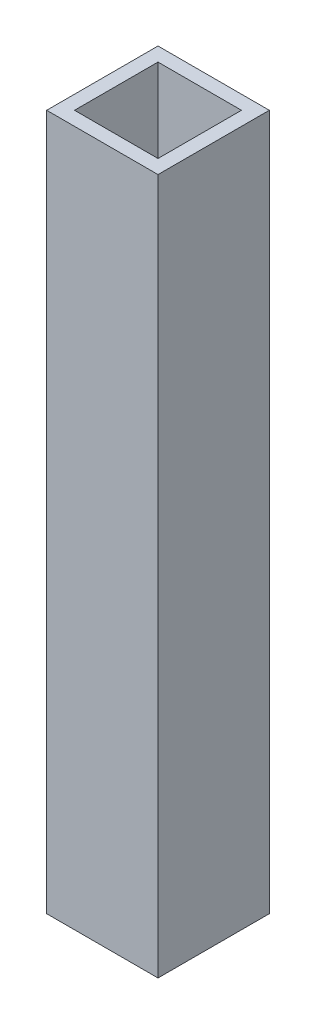
ISO-10303-21;
HEADER;
FILE_DESCRIPTION(('STEP AP214'),'2;1');
FILE_NAME('part.step','',(''),(''),'','','');
FILE_SCHEMA(('AUTOMOTIVE_DESIGN { 1 0 10303 214 1 1 1 1 }'));
ENDSEC;
DATA;
#1=APPLICATION_CONTEXT('core data for automotive mechanical design processes');
#2=APPLICATION_PROTOCOL_DEFINITION('international standard','automotive_design',2000,#1);
#3=PRODUCT_CONTEXT('',#1,'mechanical');
#4=PRODUCT('Part','Part','',(#3));
#5=PRODUCT_RELATED_PRODUCT_CATEGORY('part','',(#4));
#6=PRODUCT_DEFINITION_FORMATION('','',#4);
#7=PRODUCT_DEFINITION_CONTEXT('part definition',#1,'design');
#8=PRODUCT_DEFINITION('design','',#6,#7);
#9=PRODUCT_DEFINITION_SHAPE('','',#8);
#10=(LENGTH_UNIT() NAMED_UNIT(*) SI_UNIT(.MILLI.,.METRE.));
#11=(NAMED_UNIT(*) PLANE_ANGLE_UNIT() SI_UNIT($,.RADIAN.));
#12=(NAMED_UNIT(*) SI_UNIT($,.STERADIAN.) SOLID_ANGLE_UNIT());
#13=UNCERTAINTY_MEASURE_WITH_UNIT(LENGTH_MEASURE(1.E-05),#10,'distance_accuracy_value','');
#14=(GEOMETRIC_REPRESENTATION_CONTEXT(3) GLOBAL_UNCERTAINTY_ASSIGNED_CONTEXT((#13)) GLOBAL_UNIT_ASSIGNED_CONTEXT((#10,
#11,#12)) REPRESENTATION_CONTEXT('',''));
#15=CARTESIAN_POINT('',(0.,0.,0.));
#16=DIRECTION('',(0.,0.,1.));
#17=DIRECTION('',(1.,0.,0.));
#18=AXIS2_PLACEMENT_3D('',#15,#16,#17);
#19=CARTESIAN_POINT('',(0.,250.,0.));
#20=DIRECTION('',(0.,1.,0.));
#21=DIRECTION('',(0.,0.,1.));
#22=AXIS2_PLACEMENT_3D('',#19,#20,#21);
#23=PLANE('',#22);
#24=DIRECTION('',(1.,0.,0.));
#25=VECTOR('',#24,1.);
#26=CARTESIAN_POINT('',(-5.,250.,5.));
#27=LINE('',#26,#25);
#28=CARTESIAN_POINT('',(-5.,250.,5.));
#29=VERTEX_POINT('',#28);
#30=CARTESIAN_POINT('',(35.,250.,5.));
#31=VERTEX_POINT('',#30);
#32=EDGE_CURVE('E142',#29,#31,#27,.T.);
#33=ORIENTED_EDGE('',*,*,#32,.T.);
#34=DIRECTION('',(0.,0.,-1.));
#35=VECTOR('',#34,1.);
#36=CARTESIAN_POINT('',(35.,250.,5.));
#37=LINE('',#36,#35);
#38=CARTESIAN_POINT('',(35.,250.,-35.));
#39=VERTEX_POINT('',#38);
#40=EDGE_CURVE('E145',#31,#39,#37,.T.);
#41=ORIENTED_EDGE('',*,*,#40,.T.);
#42=DIRECTION('',(-1.,0.,0.));
#43=VECTOR('',#42,1.);
#44=CARTESIAN_POINT('',(-5.,250.,-35.));
#45=LINE('',#44,#43);
#46=CARTESIAN_POINT('',(-5.,250.,-35.));
#47=VERTEX_POINT('',#46);
#48=EDGE_CURVE('E148',#39,#47,#45,.T.);
#49=ORIENTED_EDGE('',*,*,#48,.T.);
#50=DIRECTION('',(0.,0.,1.));
#51=VECTOR('',#50,1.);
#52=CARTESIAN_POINT('',(-5.,250.,5.));
#53=LINE('',#52,#51);
#54=EDGE_CURVE('E150',#47,#29,#53,.T.);
#55=ORIENTED_EDGE('',*,*,#54,.T.);
#56=EDGE_LOOP('',(#33,#41,#49,#55));
#57=FACE_BOUND('',#56,.T.);
#58=DIRECTION('',(1.,0.,0.));
#59=VECTOR('',#58,1.);
#60=CARTESIAN_POINT('',(0.,250.,0.));
#61=LINE('',#60,#59);
#62=CARTESIAN_POINT('',(0.,250.,0.));
#63=VERTEX_POINT('',#62);
#64=CARTESIAN_POINT('',(30.,250.,0.));
#65=VERTEX_POINT('',#64);
#66=EDGE_CURVE('E114',#63,#65,#61,.T.);
#67=ORIENTED_EDGE('',*,*,#66,.F.);
#68=DIRECTION('',(0.,0.,1.));
#69=VECTOR('',#68,1.);
#70=CARTESIAN_POINT('',(0.,250.,0.));
#71=LINE('',#70,#69);
#72=CARTESIAN_POINT('',(0.,250.,-30.));
#73=VERTEX_POINT('',#72);
#74=EDGE_CURVE('E106',#73,#63,#71,.T.);
#75=ORIENTED_EDGE('',*,*,#74,.F.);
#76=DIRECTION('',(-1.,0.,0.));
#77=VECTOR('',#76,1.);
#78=CARTESIAN_POINT('',(0.,250.,-30.));
#79=LINE('',#78,#77);
#80=CARTESIAN_POINT('',(30.,250.,-30.));
#81=VERTEX_POINT('',#80);
#82=EDGE_CURVE('E128',#81,#73,#79,.T.);
#83=ORIENTED_EDGE('',*,*,#82,.F.);
#84=DIRECTION('',(0.,0.,-1.));
#85=VECTOR('',#84,1.);
#86=CARTESIAN_POINT('',(30.,250.,0.));
#87=LINE('',#86,#85);
#88=EDGE_CURVE('E126',#65,#81,#87,.T.);
#89=ORIENTED_EDGE('',*,*,#88,.F.);
#90=EDGE_LOOP('',(#67,#75,#83,#89));
#91=FACE_BOUND('',#90,.T.);
#92=ADVANCED_FACE('F41',(#57,#91),#23,.T.);
#93=CARTESIAN_POINT('',(0.,0.,0.));
#94=DIRECTION('',(0.,1.,0.));
#95=DIRECTION('',(0.,0.,1.));
#96=AXIS2_PLACEMENT_3D('',#93,#94,#95);
#97=PLANE('',#96);
#98=DIRECTION('',(1.,0.,0.));
#99=VECTOR('',#98,1.);
#100=CARTESIAN_POINT('',(-5.,0.,5.));
#101=LINE('',#100,#99);
#102=CARTESIAN_POINT('',(-5.,0.,5.));
#103=VERTEX_POINT('',#102);
#104=CARTESIAN_POINT('',(35.,0.,5.));
#105=VERTEX_POINT('',#104);
#106=EDGE_CURVE('E122',#103,#105,#101,.T.);
#107=ORIENTED_EDGE('',*,*,#106,.F.);
#108=DIRECTION('',(0.,0.,1.));
#109=VECTOR('',#108,1.);
#110=CARTESIAN_POINT('',(-5.,0.,5.));
#111=LINE('',#110,#109);
#112=CARTESIAN_POINT('',(-5.,0.,-35.));
#113=VERTEX_POINT('',#112);
#114=EDGE_CURVE('E146',#113,#103,#111,.T.);
#115=ORIENTED_EDGE('',*,*,#114,.F.);
#116=DIRECTION('',(-1.,0.,0.));
#117=VECTOR('',#116,1.);
#118=CARTESIAN_POINT('',(-5.,0.,-35.));
#119=LINE('',#118,#117);
#120=CARTESIAN_POINT('',(35.,0.,-35.));
#121=VERTEX_POINT('',#120);
#122=EDGE_CURVE('E157',#121,#113,#119,.T.);
#123=ORIENTED_EDGE('',*,*,#122,.F.);
#124=DIRECTION('',(0.,0.,-1.));
#125=VECTOR('',#124,1.);
#126=CARTESIAN_POINT('',(35.,0.,5.));
#127=LINE('',#126,#125);
#128=EDGE_CURVE('E155',#105,#121,#127,.T.);
#129=ORIENTED_EDGE('',*,*,#128,.F.);
#130=EDGE_LOOP('',(#107,#115,#123,#129));
#131=FACE_BOUND('',#130,.T.);
#132=DIRECTION('',(0.,0.,1.));
#133=VECTOR('',#132,1.);
#134=CARTESIAN_POINT('',(0.,0.,0.));
#135=LINE('',#134,#133);
#136=CARTESIAN_POINT('',(0.,0.,-30.));
#137=VERTEX_POINT('',#136);
#138=CARTESIAN_POINT('',(0.,0.,0.));
#139=VERTEX_POINT('',#138);
#140=EDGE_CURVE('E64',#137,#139,#135,.T.);
#141=ORIENTED_EDGE('',*,*,#140,.T.);
#142=DIRECTION('',(1.,0.,0.));
#143=VECTOR('',#142,1.);
#144=CARTESIAN_POINT('',(0.,0.,0.));
#145=LINE('',#144,#143);
#146=CARTESIAN_POINT('',(30.,0.,0.));
#147=VERTEX_POINT('',#146);
#148=EDGE_CURVE('E121',#139,#147,#145,.T.);
#149=ORIENTED_EDGE('',*,*,#148,.T.);
#150=DIRECTION('',(0.,0.,-1.));
#151=VECTOR('',#150,1.);
#152=CARTESIAN_POINT('',(30.,0.,0.));
#153=LINE('',#152,#151);
#154=CARTESIAN_POINT('',(30.,0.,-30.));
#155=VERTEX_POINT('',#154);
#156=EDGE_CURVE('E134',#147,#155,#153,.T.);
#157=ORIENTED_EDGE('',*,*,#156,.T.);
#158=DIRECTION('',(-1.,0.,0.));
#159=VECTOR('',#158,1.);
#160=CARTESIAN_POINT('',(0.,0.,-30.));
#161=LINE('',#160,#159);
#162=EDGE_CURVE('E115',#155,#137,#161,.T.);
#163=ORIENTED_EDGE('',*,*,#162,.T.);
#164=EDGE_LOOP('',(#141,#149,#157,#163));
#165=FACE_BOUND('',#164,.T.);
#166=ADVANCED_FACE('F175',(#131,#165),#97,.F.);
#167=CARTESIAN_POINT('',(-5.,250.,5.));
#168=DIRECTION('',(0.,0.,-1.));
#169=DIRECTION('',(-1.,0.,0.));
#170=AXIS2_PLACEMENT_3D('',#167,#168,#169);
#171=PLANE('',#170);
#172=ORIENTED_EDGE('',*,*,#106,.T.);
#173=DIRECTION('',(0.,-1.,0.));
#174=VECTOR('',#173,1.);
#175=CARTESIAN_POINT('',(35.,250.,5.));
#176=LINE('',#175,#174);
#177=EDGE_CURVE('E11',#31,#105,#176,.T.);
#178=ORIENTED_EDGE('',*,*,#177,.F.);
#179=ORIENTED_EDGE('',*,*,#32,.F.);
#180=DIRECTION('',(0.,-1.,0.));
#181=VECTOR('',#180,1.);
#182=CARTESIAN_POINT('',(-5.,250.,5.));
#183=LINE('',#182,#181);
#184=EDGE_CURVE('E152',#29,#103,#183,.T.);
#185=ORIENTED_EDGE('',*,*,#184,.T.);
#186=EDGE_LOOP('',(#172,#178,#179,#185));
#187=FACE_BOUND('',#186,.T.);
#188=ADVANCED_FACE('F43',(#187),#171,.F.);
#189=CARTESIAN_POINT('',(35.,250.,5.));
#190=DIRECTION('',(-1.,0.,0.));
#191=DIRECTION('',(0.,0.,1.));
#192=AXIS2_PLACEMENT_3D('',#189,#190,#191);
#193=PLANE('',#192);
#194=ORIENTED_EDGE('',*,*,#128,.T.);
#195=DIRECTION('',(0.,-1.,0.));
#196=VECTOR('',#195,1.);
#197=CARTESIAN_POINT('',(35.,250.,-35.));
#198=LINE('',#197,#196);
#199=EDGE_CURVE('E49',#39,#121,#198,.T.);
#200=ORIENTED_EDGE('',*,*,#199,.F.);
#201=ORIENTED_EDGE('',*,*,#40,.F.);
#202=ORIENTED_EDGE('',*,*,#177,.T.);
#203=EDGE_LOOP('',(#194,#200,#201,#202));
#204=FACE_BOUND('',#203,.T.);
#205=ADVANCED_FACE('F185',(#204),#193,.F.);
#206=CARTESIAN_POINT('',(-5.,250.,-35.));
#207=DIRECTION('',(0.,0.,1.));
#208=DIRECTION('',(1.,0.,0.));
#209=AXIS2_PLACEMENT_3D('',#206,#207,#208);
#210=PLANE('',#209);
#211=ORIENTED_EDGE('',*,*,#122,.T.);
#212=DIRECTION('',(0.,-1.,0.));
#213=VECTOR('',#212,1.);
#214=CARTESIAN_POINT('',(-5.,250.,-35.));
#215=LINE('',#214,#213);
#216=EDGE_CURVE('E162',#47,#113,#215,.T.);
#217=ORIENTED_EDGE('',*,*,#216,.F.);
#218=ORIENTED_EDGE('',*,*,#48,.F.);
#219=ORIENTED_EDGE('',*,*,#199,.T.);
#220=EDGE_LOOP('',(#211,#217,#218,#219));
#221=FACE_BOUND('',#220,.T.);
#222=ADVANCED_FACE('F169',(#221),#210,.F.);
#223=CARTESIAN_POINT('',(-5.,250.,5.));
#224=DIRECTION('',(1.,0.,0.));
#225=DIRECTION('',(0.,0.,-1.));
#226=AXIS2_PLACEMENT_3D('',#223,#224,#225);
#227=PLANE('',#226);
#228=ORIENTED_EDGE('',*,*,#114,.T.);
#229=ORIENTED_EDGE('',*,*,#184,.F.);
#230=ORIENTED_EDGE('',*,*,#54,.F.);
#231=ORIENTED_EDGE('',*,*,#216,.T.);
#232=EDGE_LOOP('',(#228,#229,#230,#231));
#233=FACE_BOUND('',#232,.T.);
#234=ADVANCED_FACE('F179',(#233),#227,.F.);
#235=CARTESIAN_POINT('',(0.,250.,0.));
#236=DIRECTION('',(1.,0.,0.));
#237=DIRECTION('',(0.,0.,-1.));
#238=AXIS2_PLACEMENT_3D('',#235,#236,#237);
#239=PLANE('',#238);
#240=ORIENTED_EDGE('',*,*,#140,.F.);
#241=DIRECTION('',(0.,-1.,0.));
#242=VECTOR('',#241,1.);
#243=CARTESIAN_POINT('',(0.,250.,-30.));
#244=LINE('',#243,#242);
#245=EDGE_CURVE('E110',#73,#137,#244,.T.);
#246=ORIENTED_EDGE('',*,*,#245,.F.);
#247=ORIENTED_EDGE('',*,*,#74,.T.);
#248=DIRECTION('',(0.,-1.,0.));
#249=VECTOR('',#248,1.);
#250=CARTESIAN_POINT('',(0.,250.,0.));
#251=LINE('',#250,#249);
#252=EDGE_CURVE('E109',#63,#139,#251,.T.);
#253=ORIENTED_EDGE('',*,*,#252,.T.);
#254=EDGE_LOOP('',(#240,#246,#247,#253));
#255=FACE_BOUND('',#254,.T.);
#256=ADVANCED_FACE('F108',(#255),#239,.T.);
#257=CARTESIAN_POINT('',(0.,250.,0.));
#258=DIRECTION('',(0.,0.,-1.));
#259=DIRECTION('',(-1.,0.,0.));
#260=AXIS2_PLACEMENT_3D('',#257,#258,#259);
#261=PLANE('',#260);
#262=ORIENTED_EDGE('',*,*,#148,.F.);
#263=ORIENTED_EDGE('',*,*,#252,.F.);
#264=ORIENTED_EDGE('',*,*,#66,.T.);
#265=DIRECTION('',(0.,-1.,0.));
#266=VECTOR('',#265,1.);
#267=CARTESIAN_POINT('',(30.,250.,0.));
#268=LINE('',#267,#266);
#269=EDGE_CURVE('E123',#65,#147,#268,.T.);
#270=ORIENTED_EDGE('',*,*,#269,.T.);
#271=EDGE_LOOP('',(#262,#263,#264,#270));
#272=FACE_BOUND('',#271,.T.);
#273=ADVANCED_FACE('F118',(#272),#261,.T.);
#274=CARTESIAN_POINT('',(30.,250.,0.));
#275=DIRECTION('',(-1.,0.,0.));
#276=DIRECTION('',(0.,0.,1.));
#277=AXIS2_PLACEMENT_3D('',#274,#275,#276);
#278=PLANE('',#277);
#279=ORIENTED_EDGE('',*,*,#156,.F.);
#280=ORIENTED_EDGE('',*,*,#269,.F.);
#281=ORIENTED_EDGE('',*,*,#88,.T.);
#282=DIRECTION('',(0.,-1.,0.));
#283=VECTOR('',#282,1.);
#284=CARTESIAN_POINT('',(30.,250.,-30.));
#285=LINE('',#284,#283);
#286=EDGE_CURVE('E56',#81,#155,#285,.T.);
#287=ORIENTED_EDGE('',*,*,#286,.T.);
#288=EDGE_LOOP('',(#279,#280,#281,#287));
#289=FACE_BOUND('',#288,.T.);
#290=ADVANCED_FACE('F208',(#289),#278,.T.);
#291=CARTESIAN_POINT('',(0.,250.,-30.));
#292=DIRECTION('',(0.,0.,1.));
#293=DIRECTION('',(1.,0.,0.));
#294=AXIS2_PLACEMENT_3D('',#291,#292,#293);
#295=PLANE('',#294);
#296=ORIENTED_EDGE('',*,*,#162,.F.);
#297=ORIENTED_EDGE('',*,*,#286,.F.);
#298=ORIENTED_EDGE('',*,*,#82,.T.);
#299=ORIENTED_EDGE('',*,*,#245,.T.);
#300=EDGE_LOOP('',(#296,#297,#298,#299));
#301=FACE_BOUND('',#300,.T.);
#302=ADVANCED_FACE('F212',(#301),#295,.T.);
#303=CLOSED_SHELL('',(#92,#166,#188,#205,#222,#234,#256,#273,#290,#302));
#304=MANIFOLD_SOLID_BREP('B2',#303);
#305=ADVANCED_BREP_SHAPE_REPRESENTATION('',(#18,#304),#14);
#306=SHAPE_DEFINITION_REPRESENTATION(#9,#305);
ENDSEC;
END-ISO-10303-21;
